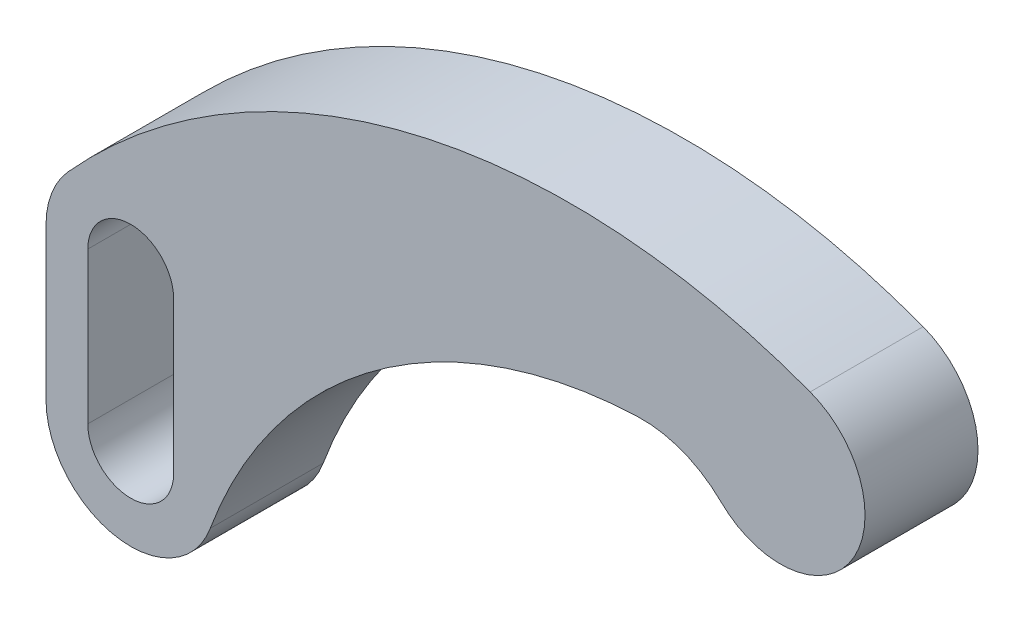
ISO-10303-21;
HEADER;
FILE_DESCRIPTION(('STEP AP214'),'2;1');
FILE_NAME('part.step','',(''),(''),'','','');
FILE_SCHEMA(('AUTOMOTIVE_DESIGN { 1 0 10303 214 1 1 1 1 }'));
ENDSEC;
DATA;
#1=APPLICATION_CONTEXT('core data for automotive mechanical design processes');
#2=APPLICATION_PROTOCOL_DEFINITION('international standard','automotive_design',2000,#1);
#3=PRODUCT_CONTEXT('',#1,'mechanical');
#4=PRODUCT('Part','Part','',(#3));
#5=PRODUCT_RELATED_PRODUCT_CATEGORY('part','',(#4));
#6=PRODUCT_DEFINITION_FORMATION('','',#4);
#7=PRODUCT_DEFINITION_CONTEXT('part definition',#1,'design');
#8=PRODUCT_DEFINITION('design','',#6,#7);
#9=PRODUCT_DEFINITION_SHAPE('','',#8);
#10=(LENGTH_UNIT() NAMED_UNIT(*) SI_UNIT(.MILLI.,.METRE.));
#11=(NAMED_UNIT(*) PLANE_ANGLE_UNIT() SI_UNIT($,.RADIAN.));
#12=(NAMED_UNIT(*) SI_UNIT($,.STERADIAN.) SOLID_ANGLE_UNIT());
#13=UNCERTAINTY_MEASURE_WITH_UNIT(LENGTH_MEASURE(1.E-05),#10,'distance_accuracy_value','');
#14=(GEOMETRIC_REPRESENTATION_CONTEXT(3) GLOBAL_UNCERTAINTY_ASSIGNED_CONTEXT((#13)) GLOBAL_UNIT_ASSIGNED_CONTEXT((#10,
#11,#12)) REPRESENTATION_CONTEXT('',''));
#15=CARTESIAN_POINT('',(0.,0.,0.));
#16=DIRECTION('',(0.,0.,1.));
#17=DIRECTION('',(1.,0.,0.));
#18=AXIS2_PLACEMENT_3D('',#15,#16,#17);
#19=CARTESIAN_POINT('',(-146.05,-35.56,25.4));
#20=DIRECTION('',(0.,0.,1.));
#21=DIRECTION('',(1.,0.,0.));
#22=AXIS2_PLACEMENT_3D('',#19,#20,#21);
#23=PLANE('',#22);
#24=CARTESIAN_POINT('',(-146.05,-35.56,25.4));
#25=DIRECTION('',(0.,0.,1.));
#26=DIRECTION('',(1.,0.,0.));
#27=AXIS2_PLACEMENT_3D('',#24,#25,#26);
#28=CIRCLE('',#27,19.0500000000001);
#29=CARTESIAN_POINT('',(-160.204760740193,-22.8106765517581,25.4));
#30=VERTEX_POINT('',#29);
#31=CARTESIAN_POINT('',(-165.1,-35.56,25.4));
#32=VERTEX_POINT('',#31);
#33=EDGE_CURVE('E171',#30,#32,#28,.T.);
#34=ORIENTED_EDGE('',*,*,#33,.T.);
#35=DIRECTION('',(0.,-1.,0.));
#36=VECTOR('',#35,1.);
#37=CARTESIAN_POINT('',(-165.1,-35.56,25.4));
#38=LINE('',#37,#36);
#39=CARTESIAN_POINT('',(-165.1,-69.596,25.4));
#40=VERTEX_POINT('',#39);
#41=EDGE_CURVE('E175',#32,#40,#38,.T.);
#42=ORIENTED_EDGE('',*,*,#41,.T.);
#43=CARTESIAN_POINT('',(-146.05,-69.596,25.4));
#44=DIRECTION('',(0.,0.,1.));
#45=DIRECTION('',(1.,0.,0.));
#46=AXIS2_PLACEMENT_3D('',#43,#44,#45);
#47=CIRCLE('',#46,19.05);
#48=CARTESIAN_POINT('',(-128.169572983258,-76.1681252041468,25.4));
#49=VERTEX_POINT('',#48);
#50=EDGE_CURVE('E179',#40,#49,#47,.T.);
#51=ORIENTED_EDGE('',*,*,#50,.T.);
#52=CARTESIAN_POINT('',(-28.0391816895062,-112.972026347369,25.4));
#53=DIRECTION('',(0.,0.,-1.));
#54=DIRECTION('',(1.,0.,0.));
#55=AXIS2_PLACEMENT_3D('',#52,#53,#54);
#56=CIRCLE('',#55,106.68);
#57=CARTESIAN_POINT('',(-32.0676878720464,-6.36811676644733,25.4));
#58=VERTEX_POINT('',#57);
#59=EDGE_CURVE('E182',#49,#58,#56,.T.);
#60=ORIENTED_EDGE('',*,*,#59,.T.);
#61=CARTESIAN_POINT('',(-31.1085197333463,-31.75,25.4));
#62=DIRECTION('',(0.,0.,-1.));
#63=DIRECTION('',(1.,0.,0.));
#64=AXIS2_PLACEMENT_3D('',#61,#62,#63);
#65=CIRCLE('',#64,25.4);
#66=CARTESIAN_POINT('',(-13.3322227428627,-13.6071428571429,25.4));
#67=VERTEX_POINT('',#66);
#68=EDGE_CURVE('E185',#58,#67,#65,.T.);
#69=ORIENTED_EDGE('',*,*,#68,.T.);
#70=CARTESIAN_POINT('',(0.,0.,25.4));
#71=DIRECTION('',(0.,0.,1.));
#72=DIRECTION('',(1.,0.,0.));
#73=AXIS2_PLACEMENT_3D('',#70,#71,#72);
#74=CIRCLE('',#73,19.05);
#75=CARTESIAN_POINT('',(6.70952497409267,17.8293234482419,25.4));
#76=VERTEX_POINT('',#75);
#77=EDGE_CURVE('E188',#67,#76,#74,.T.);
#78=ORIENTED_EDGE('',*,*,#77,.T.);
#79=CARTESIAN_POINT('',(-46.9666748186487,-124.805264137693,25.4));
#80=DIRECTION('',(0.,0.,1.));
#81=DIRECTION('',(1.,0.,0.));
#82=AXIS2_PLACEMENT_3D('',#79,#80,#81);
#83=CIRCLE('',#82,152.4);
#84=EDGE_CURVE('E191',#76,#30,#83,.T.);
#85=ORIENTED_EDGE('',*,*,#84,.T.);
#86=EDGE_LOOP('',(#34,#42,#51,#60,#69,#78,#85));
#87=FACE_BOUND('',#86,.T.);
#88=DIRECTION('',(0.,-1.,0.));
#89=VECTOR('',#88,1.);
#90=CARTESIAN_POINT('',(-155.702,-35.56,25.4));
#91=LINE('',#90,#89);
#92=CARTESIAN_POINT('',(-155.702,-35.56,25.4));
#93=VERTEX_POINT('',#92);
#94=CARTESIAN_POINT('',(-155.702,-69.596,25.4));
#95=VERTEX_POINT('',#94);
#96=EDGE_CURVE('E132',#93,#95,#91,.T.);
#97=ORIENTED_EDGE('',*,*,#96,.F.);
#98=CARTESIAN_POINT('',(-146.05,-35.56,25.4));
#99=DIRECTION('',(0.,0.,1.));
#100=DIRECTION('',(1.,0.,0.));
#101=AXIS2_PLACEMENT_3D('',#98,#99,#100);
#102=CIRCLE('',#101,9.65199999999999);
#103=CARTESIAN_POINT('',(-136.398,-35.56,25.4));
#104=VERTEX_POINT('',#103);
#105=EDGE_CURVE('E123',#104,#93,#102,.T.);
#106=ORIENTED_EDGE('',*,*,#105,.F.);
#107=DIRECTION('',(0.,1.,0.));
#108=VECTOR('',#107,1.);
#109=CARTESIAN_POINT('',(-136.398,-35.56,25.4));
#110=LINE('',#109,#108);
#111=CARTESIAN_POINT('',(-136.398,-69.596,25.4));
#112=VERTEX_POINT('',#111);
#113=EDGE_CURVE('E149',#112,#104,#110,.T.);
#114=ORIENTED_EDGE('',*,*,#113,.F.);
#115=CARTESIAN_POINT('',(-146.05,-69.596,25.4));
#116=DIRECTION('',(0.,0.,1.));
#117=DIRECTION('',(1.,0.,0.));
#118=AXIS2_PLACEMENT_3D('',#115,#116,#117);
#119=CIRCLE('',#118,9.65199999999999);
#120=EDGE_CURVE('E145',#95,#112,#119,.T.);
#121=ORIENTED_EDGE('',*,*,#120,.F.);
#122=EDGE_LOOP('',(#97,#106,#114,#121));
#123=FACE_BOUND('',#122,.T.);
#124=ADVANCED_FACE('F39',(#87,#123),#23,.T.);
#125=CARTESIAN_POINT('',(-146.05,-35.56,0.));
#126=DIRECTION('',(0.,0.,1.));
#127=DIRECTION('',(1.,0.,0.));
#128=AXIS2_PLACEMENT_3D('',#125,#126,#127);
#129=PLANE('',#128);
#130=CARTESIAN_POINT('',(-146.05,-35.56,0.));
#131=DIRECTION('',(0.,0.,1.));
#132=DIRECTION('',(1.,0.,0.));
#133=AXIS2_PLACEMENT_3D('',#130,#131,#132);
#134=CIRCLE('',#133,19.0500000000001);
#135=CARTESIAN_POINT('',(-160.204760740193,-22.8106765517581,0.));
#136=VERTEX_POINT('',#135);
#137=CARTESIAN_POINT('',(-165.1,-35.56,0.));
#138=VERTEX_POINT('',#137);
#139=EDGE_CURVE('E141',#136,#138,#134,.T.);
#140=ORIENTED_EDGE('',*,*,#139,.F.);
#141=CARTESIAN_POINT('',(-46.9666748186487,-124.805264137693,0.));
#142=DIRECTION('',(0.,0.,1.));
#143=DIRECTION('',(1.,0.,0.));
#144=AXIS2_PLACEMENT_3D('',#141,#142,#143);
#145=CIRCLE('',#144,152.4);
#146=CARTESIAN_POINT('',(6.70952497409267,17.8293234482419,0.));
#147=VERTEX_POINT('',#146);
#148=EDGE_CURVE('E176',#147,#136,#145,.T.);
#149=ORIENTED_EDGE('',*,*,#148,.F.);
#150=CARTESIAN_POINT('',(0.,0.,0.));
#151=DIRECTION('',(0.,0.,1.));
#152=DIRECTION('',(1.,0.,0.));
#153=AXIS2_PLACEMENT_3D('',#150,#151,#152);
#154=CIRCLE('',#153,19.05);
#155=CARTESIAN_POINT('',(-13.3322227428627,-13.6071428571429,0.));
#156=VERTEX_POINT('',#155);
#157=EDGE_CURVE('E210',#156,#147,#154,.T.);
#158=ORIENTED_EDGE('',*,*,#157,.F.);
#159=CARTESIAN_POINT('',(-31.1085197333463,-31.75,0.));
#160=DIRECTION('',(0.,0.,-1.));
#161=DIRECTION('',(1.,0.,0.));
#162=AXIS2_PLACEMENT_3D('',#159,#160,#161);
#163=CIRCLE('',#162,25.4);
#164=CARTESIAN_POINT('',(-32.0676878720464,-6.36811676644733,0.));
#165=VERTEX_POINT('',#164);
#166=EDGE_CURVE('E207',#165,#156,#163,.T.);
#167=ORIENTED_EDGE('',*,*,#166,.F.);
#168=CARTESIAN_POINT('',(-28.0391816895062,-112.972026347369,0.));
#169=DIRECTION('',(0.,0.,-1.));
#170=DIRECTION('',(1.,0.,0.));
#171=AXIS2_PLACEMENT_3D('',#168,#169,#170);
#172=CIRCLE('',#171,106.68);
#173=CARTESIAN_POINT('',(-128.169572983258,-76.1681252041468,0.));
#174=VERTEX_POINT('',#173);
#175=EDGE_CURVE('E204',#174,#165,#172,.T.);
#176=ORIENTED_EDGE('',*,*,#175,.F.);
#177=CARTESIAN_POINT('',(-146.05,-69.596,0.));
#178=DIRECTION('',(0.,0.,1.));
#179=DIRECTION('',(1.,0.,0.));
#180=AXIS2_PLACEMENT_3D('',#177,#178,#179);
#181=CIRCLE('',#180,19.05);
#182=CARTESIAN_POINT('',(-165.1,-69.596,0.));
#183=VERTEX_POINT('',#182);
#184=EDGE_CURVE('E201',#183,#174,#181,.T.);
#185=ORIENTED_EDGE('',*,*,#184,.F.);
#186=DIRECTION('',(0.,-1.,0.));
#187=VECTOR('',#186,1.);
#188=CARTESIAN_POINT('',(-165.1,-35.56,0.));
#189=LINE('',#188,#187);
#190=EDGE_CURVE('E198',#138,#183,#189,.T.);
#191=ORIENTED_EDGE('',*,*,#190,.F.);
#192=EDGE_LOOP('',(#140,#149,#158,#167,#176,#185,#191));
#193=FACE_BOUND('',#192,.T.);
#194=CARTESIAN_POINT('',(-146.05,-35.56,0.));
#195=DIRECTION('',(0.,0.,1.));
#196=DIRECTION('',(1.,0.,0.));
#197=AXIS2_PLACEMENT_3D('',#194,#195,#196);
#198=CIRCLE('',#197,9.65199999999999);
#199=CARTESIAN_POINT('',(-136.398,-35.56,0.));
#200=VERTEX_POINT('',#199);
#201=CARTESIAN_POINT('',(-155.702,-35.56,0.));
#202=VERTEX_POINT('',#201);
#203=EDGE_CURVE('E63',#200,#202,#198,.T.);
#204=ORIENTED_EDGE('',*,*,#203,.T.);
#205=DIRECTION('',(0.,-1.,0.));
#206=VECTOR('',#205,1.);
#207=CARTESIAN_POINT('',(-155.702,-35.56,0.));
#208=LINE('',#207,#206);
#209=CARTESIAN_POINT('',(-155.702,-69.596,0.));
#210=VERTEX_POINT('',#209);
#211=EDGE_CURVE('E139',#202,#210,#208,.T.);
#212=ORIENTED_EDGE('',*,*,#211,.T.);
#213=CARTESIAN_POINT('',(-146.05,-69.596,0.));
#214=DIRECTION('',(0.,0.,1.));
#215=DIRECTION('',(1.,0.,0.));
#216=AXIS2_PLACEMENT_3D('',#213,#214,#215);
#217=CIRCLE('',#216,9.65199999999999);
#218=CARTESIAN_POINT('',(-136.398,-69.596,0.));
#219=VERTEX_POINT('',#218);
#220=EDGE_CURVE('E158',#210,#219,#217,.T.);
#221=ORIENTED_EDGE('',*,*,#220,.T.);
#222=DIRECTION('',(0.,1.,0.));
#223=VECTOR('',#222,1.);
#224=CARTESIAN_POINT('',(-136.398,-35.56,0.));
#225=LINE('',#224,#223);
#226=EDGE_CURVE('E133',#219,#200,#225,.T.);
#227=ORIENTED_EDGE('',*,*,#226,.T.);
#228=EDGE_LOOP('',(#204,#212,#221,#227));
#229=FACE_BOUND('',#228,.T.);
#230=ADVANCED_FACE('F245',(#193,#229),#129,.F.);
#231=CARTESIAN_POINT('',(-146.05,-35.56,25.4));
#232=DIRECTION('',(0.,0.,-1.));
#233=DIRECTION('',(-1.,0.,0.));
#234=AXIS2_PLACEMENT_3D('',#231,#232,#233);
#235=CYLINDRICAL_SURFACE('',#234,19.0500000000001);
#236=ORIENTED_EDGE('',*,*,#139,.T.);
#237=DIRECTION('',(0.,0.,-1.));
#238=VECTOR('',#237,1.);
#239=CARTESIAN_POINT('',(-165.1,-35.56,25.4));
#240=LINE('',#239,#238);
#241=EDGE_CURVE('E11',#32,#138,#240,.T.);
#242=ORIENTED_EDGE('',*,*,#241,.F.);
#243=ORIENTED_EDGE('',*,*,#33,.F.);
#244=DIRECTION('',(0.,0.,-1.));
#245=VECTOR('',#244,1.);
#246=CARTESIAN_POINT('',(-160.204760740193,-22.8106765517581,25.4));
#247=LINE('',#246,#245);
#248=EDGE_CURVE('E194',#30,#136,#247,.T.);
#249=ORIENTED_EDGE('',*,*,#248,.T.);
#250=EDGE_LOOP('',(#236,#242,#243,#249));
#251=FACE_BOUND('',#250,.T.);
#252=ADVANCED_FACE('F41',(#251),#235,.T.);
#253=CARTESIAN_POINT('',(-165.1,-35.56,25.4));
#254=DIRECTION('',(1.,0.,0.));
#255=DIRECTION('',(0.,0.,-1.));
#256=AXIS2_PLACEMENT_3D('',#253,#254,#255);
#257=PLANE('',#256);
#258=ORIENTED_EDGE('',*,*,#190,.T.);
#259=DIRECTION('',(0.,0.,-1.));
#260=VECTOR('',#259,1.);
#261=CARTESIAN_POINT('',(-165.1,-69.596,25.4));
#262=LINE('',#261,#260);
#263=EDGE_CURVE('E48',#40,#183,#262,.T.);
#264=ORIENTED_EDGE('',*,*,#263,.F.);
#265=ORIENTED_EDGE('',*,*,#41,.F.);
#266=ORIENTED_EDGE('',*,*,#241,.T.);
#267=EDGE_LOOP('',(#258,#264,#265,#266));
#268=FACE_BOUND('',#267,.T.);
#269=ADVANCED_FACE('F262',(#268),#257,.F.);
#270=CARTESIAN_POINT('',(-146.05,-69.596,25.4));
#271=DIRECTION('',(0.,0.,-1.));
#272=DIRECTION('',(-1.,0.,0.));
#273=AXIS2_PLACEMENT_3D('',#270,#271,#272);
#274=CYLINDRICAL_SURFACE('',#273,19.05);
#275=ORIENTED_EDGE('',*,*,#184,.T.);
#276=DIRECTION('',(0.,0.,-1.));
#277=VECTOR('',#276,1.);
#278=CARTESIAN_POINT('',(-128.169572983258,-76.1681252041468,25.4));
#279=LINE('',#278,#277);
#280=EDGE_CURVE('E230',#49,#174,#279,.T.);
#281=ORIENTED_EDGE('',*,*,#280,.F.);
#282=ORIENTED_EDGE('',*,*,#50,.F.);
#283=ORIENTED_EDGE('',*,*,#263,.T.);
#284=EDGE_LOOP('',(#275,#281,#282,#283));
#285=FACE_BOUND('',#284,.T.);
#286=ADVANCED_FACE('F239',(#285),#274,.T.);
#287=CARTESIAN_POINT('',(-28.0391816895062,-112.972026347369,25.4));
#288=DIRECTION('',(0.,0.,-1.));
#289=DIRECTION('',(-1.,0.,0.));
#290=AXIS2_PLACEMENT_3D('',#287,#288,#289);
#291=CYLINDRICAL_SURFACE('',#290,106.68);
#292=ORIENTED_EDGE('',*,*,#175,.T.);
#293=DIRECTION('',(0.,0.,-1.));
#294=VECTOR('',#293,1.);
#295=CARTESIAN_POINT('',(-32.0676878720464,-6.36811676644733,25.4));
#296=LINE('',#295,#294);
#297=EDGE_CURVE('E226',#58,#165,#296,.T.);
#298=ORIENTED_EDGE('',*,*,#297,.F.);
#299=ORIENTED_EDGE('',*,*,#59,.F.);
#300=ORIENTED_EDGE('',*,*,#280,.T.);
#301=EDGE_LOOP('',(#292,#298,#299,#300));
#302=FACE_BOUND('',#301,.T.);
#303=ADVANCED_FACE('F251',(#302),#291,.F.);
#304=CARTESIAN_POINT('',(-31.1085197333463,-31.75,25.4));
#305=DIRECTION('',(0.,0.,-1.));
#306=DIRECTION('',(-1.,0.,0.));
#307=AXIS2_PLACEMENT_3D('',#304,#305,#306);
#308=CYLINDRICAL_SURFACE('',#307,25.4);
#309=ORIENTED_EDGE('',*,*,#166,.T.);
#310=DIRECTION('',(0.,0.,-1.));
#311=VECTOR('',#310,1.);
#312=CARTESIAN_POINT('',(-13.3322227428627,-13.6071428571429,25.4));
#313=LINE('',#312,#311);
#314=EDGE_CURVE('E222',#67,#156,#313,.T.);
#315=ORIENTED_EDGE('',*,*,#314,.F.);
#316=ORIENTED_EDGE('',*,*,#68,.F.);
#317=ORIENTED_EDGE('',*,*,#297,.T.);
#318=EDGE_LOOP('',(#309,#315,#316,#317));
#319=FACE_BOUND('',#318,.T.);
#320=ADVANCED_FACE('F255',(#319),#308,.F.);
#321=CARTESIAN_POINT('',(0.,0.,25.4));
#322=DIRECTION('',(0.,0.,-1.));
#323=DIRECTION('',(-1.,0.,0.));
#324=AXIS2_PLACEMENT_3D('',#321,#322,#323);
#325=CYLINDRICAL_SURFACE('',#324,19.05);
#326=ORIENTED_EDGE('',*,*,#157,.T.);
#327=DIRECTION('',(0.,0.,-1.));
#328=VECTOR('',#327,1.);
#329=CARTESIAN_POINT('',(6.70952497409267,17.8293234482419,25.4));
#330=LINE('',#329,#328);
#331=EDGE_CURVE('E218',#76,#147,#330,.T.);
#332=ORIENTED_EDGE('',*,*,#331,.F.);
#333=ORIENTED_EDGE('',*,*,#77,.F.);
#334=ORIENTED_EDGE('',*,*,#314,.T.);
#335=EDGE_LOOP('',(#326,#332,#333,#334));
#336=FACE_BOUND('',#335,.T.);
#337=ADVANCED_FACE('F270',(#336),#325,.T.);
#338=CARTESIAN_POINT('',(-46.9666748186487,-124.805264137693,25.4));
#339=DIRECTION('',(0.,0.,-1.));
#340=DIRECTION('',(-1.,0.,0.));
#341=AXIS2_PLACEMENT_3D('',#338,#339,#340);
#342=CYLINDRICAL_SURFACE('',#341,152.4);
#343=ORIENTED_EDGE('',*,*,#148,.T.);
#344=ORIENTED_EDGE('',*,*,#248,.F.);
#345=ORIENTED_EDGE('',*,*,#84,.F.);
#346=ORIENTED_EDGE('',*,*,#331,.T.);
#347=EDGE_LOOP('',(#343,#344,#345,#346));
#348=FACE_BOUND('',#347,.T.);
#349=ADVANCED_FACE('F267',(#348),#342,.T.);
#350=CARTESIAN_POINT('',(-146.05,-35.56,25.4));
#351=DIRECTION('',(0.,0.,-1.));
#352=DIRECTION('',(-1.,0.,0.));
#353=AXIS2_PLACEMENT_3D('',#350,#351,#352);
#354=CYLINDRICAL_SURFACE('',#353,9.65199999999999);
#355=ORIENTED_EDGE('',*,*,#203,.F.);
#356=DIRECTION('',(0.,0.,-1.));
#357=VECTOR('',#356,1.);
#358=CARTESIAN_POINT('',(-136.398,-35.56,25.4));
#359=LINE('',#358,#357);
#360=EDGE_CURVE('E127',#104,#200,#359,.T.);
#361=ORIENTED_EDGE('',*,*,#360,.F.);
#362=ORIENTED_EDGE('',*,*,#105,.T.);
#363=DIRECTION('',(0.,0.,-1.));
#364=VECTOR('',#363,1.);
#365=CARTESIAN_POINT('',(-155.702,-35.56,25.4));
#366=LINE('',#365,#364);
#367=EDGE_CURVE('E126',#93,#202,#366,.T.);
#368=ORIENTED_EDGE('',*,*,#367,.T.);
#369=EDGE_LOOP('',(#355,#361,#362,#368));
#370=FACE_BOUND('',#369,.T.);
#371=ADVANCED_FACE('F125',(#370),#354,.F.);
#372=CARTESIAN_POINT('',(-155.702,-35.56,25.4));
#373=DIRECTION('',(1.,0.,0.));
#374=DIRECTION('',(0.,0.,-1.));
#375=AXIS2_PLACEMENT_3D('',#372,#373,#374);
#376=PLANE('',#375);
#377=ORIENTED_EDGE('',*,*,#211,.F.);
#378=ORIENTED_EDGE('',*,*,#367,.F.);
#379=ORIENTED_EDGE('',*,*,#96,.T.);
#380=DIRECTION('',(0.,0.,-1.));
#381=VECTOR('',#380,1.);
#382=CARTESIAN_POINT('',(-155.702,-69.596,25.4));
#383=LINE('',#382,#381);
#384=EDGE_CURVE('E142',#95,#210,#383,.T.);
#385=ORIENTED_EDGE('',*,*,#384,.T.);
#386=EDGE_LOOP('',(#377,#378,#379,#385));
#387=FACE_BOUND('',#386,.T.);
#388=ADVANCED_FACE('F136',(#387),#376,.T.);
#389=CARTESIAN_POINT('',(-146.05,-69.596,25.4));
#390=DIRECTION('',(0.,0.,-1.));
#391=DIRECTION('',(-1.,0.,0.));
#392=AXIS2_PLACEMENT_3D('',#389,#390,#391);
#393=CYLINDRICAL_SURFACE('',#392,9.65199999999999);
#394=ORIENTED_EDGE('',*,*,#220,.F.);
#395=ORIENTED_EDGE('',*,*,#384,.F.);
#396=ORIENTED_EDGE('',*,*,#120,.T.);
#397=DIRECTION('',(0.,0.,-1.));
#398=VECTOR('',#397,1.);
#399=CARTESIAN_POINT('',(-136.398,-69.596,25.4));
#400=LINE('',#399,#398);
#401=EDGE_CURVE('E55',#112,#219,#400,.T.);
#402=ORIENTED_EDGE('',*,*,#401,.T.);
#403=EDGE_LOOP('',(#394,#395,#396,#402));
#404=FACE_BOUND('',#403,.T.);
#405=ADVANCED_FACE('F290',(#404),#393,.F.);
#406=CARTESIAN_POINT('',(-136.398,-35.56,25.4));
#407=DIRECTION('',(-1.,0.,0.));
#408=DIRECTION('',(0.,0.,1.));
#409=AXIS2_PLACEMENT_3D('',#406,#407,#408);
#410=PLANE('',#409);
#411=ORIENTED_EDGE('',*,*,#226,.F.);
#412=ORIENTED_EDGE('',*,*,#401,.F.);
#413=ORIENTED_EDGE('',*,*,#113,.T.);
#414=ORIENTED_EDGE('',*,*,#360,.T.);
#415=EDGE_LOOP('',(#411,#412,#413,#414));
#416=FACE_BOUND('',#415,.T.);
#417=ADVANCED_FACE('F293',(#416),#410,.T.);
#418=CLOSED_SHELL('',(#124,#230,#252,#269,#286,#303,#320,#337,#349,#371,#388,#405,#417));
#419=MANIFOLD_SOLID_BREP('B2',#418);
#420=ADVANCED_BREP_SHAPE_REPRESENTATION('',(#18,#419),#14);
#421=SHAPE_DEFINITION_REPRESENTATION(#9,#420);
ENDSEC;
END-ISO-10303-21;
